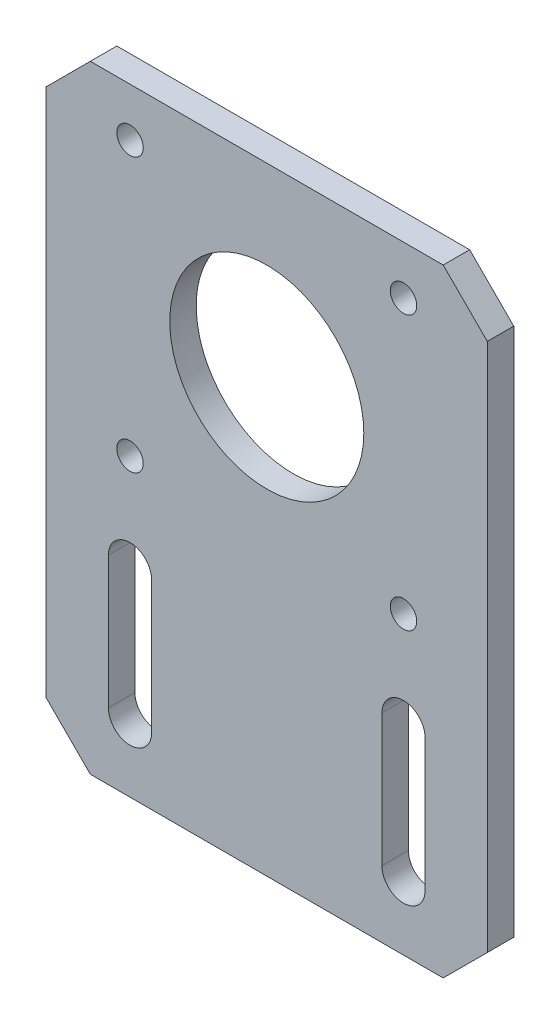
ISO-10303-21;
HEADER;
FILE_DESCRIPTION(('STEP AP214'),'2;1');
FILE_NAME('part.step','',(''),(''),'','','');
FILE_SCHEMA(('AUTOMOTIVE_DESIGN { 1 0 10303 214 1 1 1 1 }'));
ENDSEC;
DATA;
#1=APPLICATION_CONTEXT('core data for automotive mechanical design processes');
#2=APPLICATION_PROTOCOL_DEFINITION('international standard','automotive_design',2000,#1);
#3=PRODUCT_CONTEXT('',#1,'mechanical');
#4=PRODUCT('Part','Part','',(#3));
#5=PRODUCT_RELATED_PRODUCT_CATEGORY('part','',(#4));
#6=PRODUCT_DEFINITION_FORMATION('','',#4);
#7=PRODUCT_DEFINITION_CONTEXT('part definition',#1,'design');
#8=PRODUCT_DEFINITION('design','',#6,#7);
#9=PRODUCT_DEFINITION_SHAPE('','',#8);
#10=(LENGTH_UNIT() NAMED_UNIT(*) SI_UNIT(.MILLI.,.METRE.));
#11=(NAMED_UNIT(*) PLANE_ANGLE_UNIT() SI_UNIT($,.RADIAN.));
#12=(NAMED_UNIT(*) SI_UNIT($,.STERADIAN.) SOLID_ANGLE_UNIT());
#13=UNCERTAINTY_MEASURE_WITH_UNIT(LENGTH_MEASURE(1.E-05),#10,'distance_accuracy_value','');
#14=(GEOMETRIC_REPRESENTATION_CONTEXT(3) GLOBAL_UNCERTAINTY_ASSIGNED_CONTEXT((#13)) GLOBAL_UNIT_ASSIGNED_CONTEXT((#10,
#11,#12)) REPRESENTATION_CONTEXT('',''));
#15=CARTESIAN_POINT('',(0.,0.,0.));
#16=DIRECTION('',(0.,0.,1.));
#17=DIRECTION('',(1.,0.,0.));
#18=AXIS2_PLACEMENT_3D('',#15,#16,#17);
#19=CARTESIAN_POINT('',(0.,0.,3.));
#20=DIRECTION('',(0.,0.,1.));
#21=DIRECTION('',(1.,0.,0.));
#22=AXIS2_PLACEMENT_3D('',#19,#20,#21);
#23=PLANE('',#22);
#24=CARTESIAN_POINT('',(-15.5,-15.5,3.));
#25=DIRECTION('',(0.,0.,1.));
#26=DIRECTION('',(-1.,0.,0.));
#27=AXIS2_PLACEMENT_3D('',#24,#25,#26);
#28=CIRCLE('',#27,1.5);
#29=CARTESIAN_POINT('',(-17.,-15.5,3.));
#30=VERTEX_POINT('',#29);
#31=EDGE_CURVE('E254',#30,#30,#28,.T.);
#32=ORIENTED_EDGE('',*,*,#31,.F.);
#33=EDGE_LOOP('',(#32));
#34=FACE_BOUND('',#33,.T.);
#35=CARTESIAN_POINT('',(-15.5,15.5,3.));
#36=DIRECTION('',(0.,0.,1.));
#37=DIRECTION('',(1.,0.,0.));
#38=AXIS2_PLACEMENT_3D('',#35,#36,#37);
#39=CIRCLE('',#38,1.5);
#40=CARTESIAN_POINT('',(-14.,15.5,3.));
#41=VERTEX_POINT('',#40);
#42=EDGE_CURVE('E270',#41,#41,#39,.T.);
#43=ORIENTED_EDGE('',*,*,#42,.F.);
#44=EDGE_LOOP('',(#43));
#45=FACE_BOUND('',#44,.T.);
#46=DIRECTION('',(-0.707106781186548,0.707106781186548,0.));
#47=VECTOR('',#46,1.);
#48=CARTESIAN_POINT('',(25.,16.,3.));
#49=LINE('',#48,#47);
#50=CARTESIAN_POINT('',(25.,16.,3.));
#51=VERTEX_POINT('',#50);
#52=CARTESIAN_POINT('',(20.,21.,3.));
#53=VERTEX_POINT('',#52);
#54=EDGE_CURVE('E286',#51,#53,#49,.T.);
#55=ORIENTED_EDGE('',*,*,#54,.T.);
#56=DIRECTION('',(-1.,0.,0.));
#57=VECTOR('',#56,1.);
#58=CARTESIAN_POINT('',(20.,21.,3.));
#59=LINE('',#58,#57);
#60=CARTESIAN_POINT('',(-20.,21.,3.));
#61=VERTEX_POINT('',#60);
#62=EDGE_CURVE('E290',#53,#61,#59,.T.);
#63=ORIENTED_EDGE('',*,*,#62,.T.);
#64=DIRECTION('',(-0.707106781186547,-0.707106781186548,0.));
#65=VECTOR('',#64,1.);
#66=CARTESIAN_POINT('',(-20.,21.,3.));
#67=LINE('',#66,#65);
#68=CARTESIAN_POINT('',(-25.,16.,3.));
#69=VERTEX_POINT('',#68);
#70=EDGE_CURVE('E294',#61,#69,#67,.T.);
#71=ORIENTED_EDGE('',*,*,#70,.T.);
#72=DIRECTION('',(0.,-1.,0.));
#73=VECTOR('',#72,1.);
#74=CARTESIAN_POINT('',(-25.,-44.,3.));
#75=LINE('',#74,#73);
#76=CARTESIAN_POINT('',(-25.,-44.,3.));
#77=VERTEX_POINT('',#76);
#78=EDGE_CURVE('E297',#69,#77,#75,.T.);
#79=ORIENTED_EDGE('',*,*,#78,.T.);
#80=DIRECTION('',(0.707106781186548,-0.707106781186547,0.));
#81=VECTOR('',#80,1.);
#82=CARTESIAN_POINT('',(-20.,-49.,3.));
#83=LINE('',#82,#81);
#84=CARTESIAN_POINT('',(-20.,-49.,3.));
#85=VERTEX_POINT('',#84);
#86=EDGE_CURVE('E300',#77,#85,#83,.T.);
#87=ORIENTED_EDGE('',*,*,#86,.T.);
#88=DIRECTION('',(1.,0.,0.));
#89=VECTOR('',#88,1.);
#90=CARTESIAN_POINT('',(20.,-49.,3.));
#91=LINE('',#90,#89);
#92=CARTESIAN_POINT('',(20.,-49.,3.));
#93=VERTEX_POINT('',#92);
#94=EDGE_CURVE('E303',#85,#93,#91,.T.);
#95=ORIENTED_EDGE('',*,*,#94,.T.);
#96=DIRECTION('',(0.707106781186548,0.707106781186547,0.));
#97=VECTOR('',#96,1.);
#98=CARTESIAN_POINT('',(25.,-44.,3.));
#99=LINE('',#98,#97);
#100=CARTESIAN_POINT('',(25.,-44.,3.));
#101=VERTEX_POINT('',#100);
#102=EDGE_CURVE('E306',#93,#101,#99,.T.);
#103=ORIENTED_EDGE('',*,*,#102,.T.);
#104=DIRECTION('',(0.,1.,0.));
#105=VECTOR('',#104,1.);
#106=CARTESIAN_POINT('',(25.,-44.,3.));
#107=LINE('',#106,#105);
#108=EDGE_CURVE('E309',#101,#51,#107,.T.);
#109=ORIENTED_EDGE('',*,*,#108,.T.);
#110=EDGE_LOOP('',(#55,#63,#71,#79,#87,#95,#103,#109));
#111=FACE_BOUND('',#110,.T.);
#112=CARTESIAN_POINT('',(0.,0.,3.));
#113=DIRECTION('',(0.,0.,1.));
#114=DIRECTION('',(1.,0.,0.));
#115=AXIS2_PLACEMENT_3D('',#112,#113,#114);
#116=CIRCLE('',#115,11.);
#117=CARTESIAN_POINT('',(11.,0.,3.));
#118=VERTEX_POINT('',#117);
#119=EDGE_CURVE('E278',#118,#118,#116,.T.);
#120=ORIENTED_EDGE('',*,*,#119,.F.);
#121=EDGE_LOOP('',(#120));
#122=FACE_BOUND('',#121,.T.);
#123=CARTESIAN_POINT('',(15.5,15.5,3.));
#124=DIRECTION('',(0.,0.,1.));
#125=DIRECTION('',(-1.,0.,0.));
#126=AXIS2_PLACEMENT_3D('',#123,#124,#125);
#127=CIRCLE('',#126,1.5);
#128=CARTESIAN_POINT('',(14.,15.5,3.));
#129=VERTEX_POINT('',#128);
#130=EDGE_CURVE('E262',#129,#129,#127,.T.);
#131=ORIENTED_EDGE('',*,*,#130,.F.);
#132=EDGE_LOOP('',(#131));
#133=FACE_BOUND('',#132,.T.);
#134=CARTESIAN_POINT('',(15.5,-15.5,3.));
#135=DIRECTION('',(0.,0.,1.));
#136=DIRECTION('',(1.,0.,0.));
#137=AXIS2_PLACEMENT_3D('',#134,#135,#136);
#138=CIRCLE('',#137,1.5);
#139=CARTESIAN_POINT('',(17.,-15.5,3.));
#140=VERTEX_POINT('',#139);
#141=EDGE_CURVE('E246',#140,#140,#138,.T.);
#142=ORIENTED_EDGE('',*,*,#141,.F.);
#143=EDGE_LOOP('',(#142));
#144=FACE_BOUND('',#143,.T.);
#145=DIRECTION('',(0.,-1.,0.));
#146=VECTOR('',#145,1.);
#147=CARTESIAN_POINT('',(-17.95,-26.45,3.));
#148=LINE('',#147,#146);
#149=CARTESIAN_POINT('',(-17.95,-26.45,3.));
#150=VERTEX_POINT('',#149);
#151=CARTESIAN_POINT('',(-17.95,-41.45,3.));
#152=VERTEX_POINT('',#151);
#153=EDGE_CURVE('E206',#150,#152,#148,.T.);
#154=ORIENTED_EDGE('',*,*,#153,.F.);
#155=CARTESIAN_POINT('',(-15.5,-26.45,3.));
#156=DIRECTION('',(0.,0.,1.));
#157=DIRECTION('',(1.,0.,0.));
#158=AXIS2_PLACEMENT_3D('',#155,#156,#157);
#159=CIRCLE('',#158,2.45000000000001);
#160=CARTESIAN_POINT('',(-13.05,-26.45,3.));
#161=VERTEX_POINT('',#160);
#162=EDGE_CURVE('E203',#161,#150,#159,.T.);
#163=ORIENTED_EDGE('',*,*,#162,.F.);
#164=DIRECTION('',(0.,1.,0.));
#165=VECTOR('',#164,1.);
#166=CARTESIAN_POINT('',(-13.05,-26.45,3.));
#167=LINE('',#166,#165);
#168=CARTESIAN_POINT('',(-13.05,-41.45,3.));
#169=VERTEX_POINT('',#168);
#170=EDGE_CURVE('E214',#169,#161,#167,.T.);
#171=ORIENTED_EDGE('',*,*,#170,.F.);
#172=CARTESIAN_POINT('',(-15.5,-41.45,3.));
#173=DIRECTION('',(0.,0.,1.));
#174=DIRECTION('',(1.,0.,0.));
#175=AXIS2_PLACEMENT_3D('',#172,#173,#174);
#176=CIRCLE('',#175,2.45000000000002);
#177=EDGE_CURVE('E210',#152,#169,#176,.T.);
#178=ORIENTED_EDGE('',*,*,#177,.F.);
#179=EDGE_LOOP('',(#154,#163,#171,#178));
#180=FACE_BOUND('',#179,.T.);
#181=DIRECTION('',(0.,-1.,0.));
#182=VECTOR('',#181,1.);
#183=CARTESIAN_POINT('',(13.05,-26.45,3.));
#184=LINE('',#183,#182);
#185=CARTESIAN_POINT('',(13.05,-26.45,3.));
#186=VERTEX_POINT('',#185);
#187=CARTESIAN_POINT('',(13.05,-41.45,3.));
#188=VERTEX_POINT('',#187);
#189=EDGE_CURVE('E164',#186,#188,#184,.T.);
#190=ORIENTED_EDGE('',*,*,#189,.F.);
#191=CARTESIAN_POINT('',(15.5,-26.45,3.));
#192=DIRECTION('',(0.,0.,1.));
#193=DIRECTION('',(-1.,0.,0.));
#194=AXIS2_PLACEMENT_3D('',#191,#192,#193);
#195=CIRCLE('',#194,2.45000000000002);
#196=CARTESIAN_POINT('',(17.95,-26.45,3.));
#197=VERTEX_POINT('',#196);
#198=EDGE_CURVE('E155',#197,#186,#195,.T.);
#199=ORIENTED_EDGE('',*,*,#198,.F.);
#200=DIRECTION('',(0.,1.,0.));
#201=VECTOR('',#200,1.);
#202=CARTESIAN_POINT('',(17.95,-26.45,3.));
#203=LINE('',#202,#201);
#204=CARTESIAN_POINT('',(17.95,-41.45,3.));
#205=VERTEX_POINT('',#204);
#206=EDGE_CURVE('E181',#205,#197,#203,.T.);
#207=ORIENTED_EDGE('',*,*,#206,.F.);
#208=CARTESIAN_POINT('',(15.5,-41.45,3.));
#209=DIRECTION('',(0.,0.,1.));
#210=DIRECTION('',(-1.,0.,0.));
#211=AXIS2_PLACEMENT_3D('',#208,#209,#210);
#212=CIRCLE('',#211,2.45000000000002);
#213=EDGE_CURVE('E177',#188,#205,#212,.T.);
#214=ORIENTED_EDGE('',*,*,#213,.F.);
#215=EDGE_LOOP('',(#190,#199,#207,#214));
#216=FACE_BOUND('',#215,.T.);
#217=ADVANCED_FACE('F41',(#34,#45,#111,#122,#133,#144,#180,#216),#23,.T.);
#218=CARTESIAN_POINT('',(0.,0.,0.));
#219=DIRECTION('',(0.,0.,1.));
#220=DIRECTION('',(1.,0.,0.));
#221=AXIS2_PLACEMENT_3D('',#218,#219,#220);
#222=PLANE('',#221);
#223=CARTESIAN_POINT('',(-15.5,-26.45,0.));
#224=DIRECTION('',(0.,0.,1.));
#225=DIRECTION('',(1.,0.,0.));
#226=AXIS2_PLACEMENT_3D('',#223,#224,#225);
#227=CIRCLE('',#226,2.45000000000001);
#228=CARTESIAN_POINT('',(-13.05,-26.45,0.));
#229=VERTEX_POINT('',#228);
#230=CARTESIAN_POINT('',(-17.95,-26.45,0.));
#231=VERTEX_POINT('',#230);
#232=EDGE_CURVE('E173',#229,#231,#227,.T.);
#233=ORIENTED_EDGE('',*,*,#232,.T.);
#234=DIRECTION('',(0.,-1.,0.));
#235=VECTOR('',#234,1.);
#236=CARTESIAN_POINT('',(-17.95,-26.45,0.));
#237=LINE('',#236,#235);
#238=CARTESIAN_POINT('',(-17.95,-41.45,0.));
#239=VERTEX_POINT('',#238);
#240=EDGE_CURVE('E221',#231,#239,#237,.T.);
#241=ORIENTED_EDGE('',*,*,#240,.T.);
#242=CARTESIAN_POINT('',(-15.5,-41.45,0.));
#243=DIRECTION('',(0.,0.,1.));
#244=DIRECTION('',(1.,0.,0.));
#245=AXIS2_PLACEMENT_3D('',#242,#243,#244);
#246=CIRCLE('',#245,2.45000000000002);
#247=CARTESIAN_POINT('',(-13.05,-41.45,0.));
#248=VERTEX_POINT('',#247);
#249=EDGE_CURVE('E225',#239,#248,#246,.T.);
#250=ORIENTED_EDGE('',*,*,#249,.T.);
#251=DIRECTION('',(0.,1.,0.));
#252=VECTOR('',#251,1.);
#253=CARTESIAN_POINT('',(-13.05,-26.45,0.));
#254=LINE('',#253,#252);
#255=EDGE_CURVE('E207',#248,#229,#254,.T.);
#256=ORIENTED_EDGE('',*,*,#255,.T.);
#257=EDGE_LOOP('',(#233,#241,#250,#256));
#258=FACE_BOUND('',#257,.T.);
#259=DIRECTION('',(-0.707106781186548,0.707106781186548,0.));
#260=VECTOR('',#259,1.);
#261=CARTESIAN_POINT('',(25.,16.,0.));
#262=LINE('',#261,#260);
#263=CARTESIAN_POINT('',(25.,16.,0.));
#264=VERTEX_POINT('',#263);
#265=CARTESIAN_POINT('',(20.,21.,0.));
#266=VERTEX_POINT('',#265);
#267=EDGE_CURVE('E282',#264,#266,#262,.T.);
#268=ORIENTED_EDGE('',*,*,#267,.F.);
#269=DIRECTION('',(0.,1.,0.));
#270=VECTOR('',#269,1.);
#271=CARTESIAN_POINT('',(25.,-44.,0.));
#272=LINE('',#271,#270);
#273=CARTESIAN_POINT('',(25.,-44.,0.));
#274=VERTEX_POINT('',#273);
#275=EDGE_CURVE('E291',#274,#264,#272,.T.);
#276=ORIENTED_EDGE('',*,*,#275,.F.);
#277=DIRECTION('',(0.707106781186548,0.707106781186547,0.));
#278=VECTOR('',#277,1.);
#279=CARTESIAN_POINT('',(25.,-44.,0.));
#280=LINE('',#279,#278);
#281=CARTESIAN_POINT('',(20.,-49.,0.));
#282=VERTEX_POINT('',#281);
#283=EDGE_CURVE('E331',#282,#274,#280,.T.);
#284=ORIENTED_EDGE('',*,*,#283,.F.);
#285=DIRECTION('',(1.,0.,0.));
#286=VECTOR('',#285,1.);
#287=CARTESIAN_POINT('',(20.,-49.,0.));
#288=LINE('',#287,#286);
#289=CARTESIAN_POINT('',(-20.,-49.,0.));
#290=VERTEX_POINT('',#289);
#291=EDGE_CURVE('E328',#290,#282,#288,.T.);
#292=ORIENTED_EDGE('',*,*,#291,.F.);
#293=DIRECTION('',(0.707106781186548,-0.707106781186547,0.));
#294=VECTOR('',#293,1.);
#295=CARTESIAN_POINT('',(-20.,-49.,0.));
#296=LINE('',#295,#294);
#297=CARTESIAN_POINT('',(-25.,-44.,0.));
#298=VERTEX_POINT('',#297);
#299=EDGE_CURVE('E325',#298,#290,#296,.T.);
#300=ORIENTED_EDGE('',*,*,#299,.F.);
#301=DIRECTION('',(0.,-1.,0.));
#302=VECTOR('',#301,1.);
#303=CARTESIAN_POINT('',(-25.,-44.,0.));
#304=LINE('',#303,#302);
#305=CARTESIAN_POINT('',(-25.,16.,0.));
#306=VERTEX_POINT('',#305);
#307=EDGE_CURVE('E322',#306,#298,#304,.T.);
#308=ORIENTED_EDGE('',*,*,#307,.F.);
#309=DIRECTION('',(-0.707106781186547,-0.707106781186548,0.));
#310=VECTOR('',#309,1.);
#311=CARTESIAN_POINT('',(-20.,21.,0.));
#312=LINE('',#311,#310);
#313=CARTESIAN_POINT('',(-20.,21.,0.));
#314=VERTEX_POINT('',#313);
#315=EDGE_CURVE('E319',#314,#306,#312,.T.);
#316=ORIENTED_EDGE('',*,*,#315,.F.);
#317=DIRECTION('',(-1.,0.,0.));
#318=VECTOR('',#317,1.);
#319=CARTESIAN_POINT('',(20.,21.,0.));
#320=LINE('',#319,#318);
#321=EDGE_CURVE('E316',#266,#314,#320,.T.);
#322=ORIENTED_EDGE('',*,*,#321,.F.);
#323=EDGE_LOOP('',(#268,#276,#284,#292,#300,#308,#316,#322));
#324=FACE_BOUND('',#323,.T.);
#325=CARTESIAN_POINT('',(0.,0.,0.));
#326=DIRECTION('',(0.,0.,1.));
#327=DIRECTION('',(1.,0.,0.));
#328=AXIS2_PLACEMENT_3D('',#325,#326,#327);
#329=CIRCLE('',#328,11.);
#330=CARTESIAN_POINT('',(11.,0.,0.));
#331=VERTEX_POINT('',#330);
#332=EDGE_CURVE('E274',#331,#331,#329,.T.);
#333=ORIENTED_EDGE('',*,*,#332,.T.);
#334=EDGE_LOOP('',(#333));
#335=FACE_BOUND('',#334,.T.);
#336=CARTESIAN_POINT('',(-15.5,15.5,0.));
#337=DIRECTION('',(0.,0.,1.));
#338=DIRECTION('',(1.,0.,0.));
#339=AXIS2_PLACEMENT_3D('',#336,#337,#338);
#340=CIRCLE('',#339,1.5);
#341=CARTESIAN_POINT('',(-14.,15.5,0.));
#342=VERTEX_POINT('',#341);
#343=EDGE_CURVE('E266',#342,#342,#340,.T.);
#344=ORIENTED_EDGE('',*,*,#343,.T.);
#345=EDGE_LOOP('',(#344));
#346=FACE_BOUND('',#345,.T.);
#347=CARTESIAN_POINT('',(15.5,15.5,0.));
#348=DIRECTION('',(0.,0.,1.));
#349=DIRECTION('',(-1.,0.,0.));
#350=AXIS2_PLACEMENT_3D('',#347,#348,#349);
#351=CIRCLE('',#350,1.5);
#352=CARTESIAN_POINT('',(14.,15.5,0.));
#353=VERTEX_POINT('',#352);
#354=EDGE_CURVE('E258',#353,#353,#351,.T.);
#355=ORIENTED_EDGE('',*,*,#354,.T.);
#356=EDGE_LOOP('',(#355));
#357=FACE_BOUND('',#356,.T.);
#358=CARTESIAN_POINT('',(-15.5,-15.5,0.));
#359=DIRECTION('',(0.,0.,1.));
#360=DIRECTION('',(-1.,0.,0.));
#361=AXIS2_PLACEMENT_3D('',#358,#359,#360);
#362=CIRCLE('',#361,1.5);
#363=CARTESIAN_POINT('',(-17.,-15.5,0.));
#364=VERTEX_POINT('',#363);
#365=EDGE_CURVE('E250',#364,#364,#362,.T.);
#366=ORIENTED_EDGE('',*,*,#365,.T.);
#367=EDGE_LOOP('',(#366));
#368=FACE_BOUND('',#367,.T.);
#369=CARTESIAN_POINT('',(15.5,-15.5,0.));
#370=DIRECTION('',(0.,0.,1.));
#371=DIRECTION('',(1.,0.,0.));
#372=AXIS2_PLACEMENT_3D('',#369,#370,#371);
#373=CIRCLE('',#372,1.5);
#374=CARTESIAN_POINT('',(17.,-15.5,0.));
#375=VERTEX_POINT('',#374);
#376=EDGE_CURVE('E245',#375,#375,#373,.T.);
#377=ORIENTED_EDGE('',*,*,#376,.T.);
#378=EDGE_LOOP('',(#377));
#379=FACE_BOUND('',#378,.T.);
#380=CARTESIAN_POINT('',(15.5,-26.45,0.));
#381=DIRECTION('',(0.,0.,1.));
#382=DIRECTION('',(-1.,0.,0.));
#383=AXIS2_PLACEMENT_3D('',#380,#381,#382);
#384=CIRCLE('',#383,2.45000000000002);
#385=CARTESIAN_POINT('',(17.95,-26.45,0.));
#386=VERTEX_POINT('',#385);
#387=CARTESIAN_POINT('',(13.05,-26.45,0.));
#388=VERTEX_POINT('',#387);
#389=EDGE_CURVE('E65',#386,#388,#384,.T.);
#390=ORIENTED_EDGE('',*,*,#389,.T.);
#391=DIRECTION('',(0.,-1.,0.));
#392=VECTOR('',#391,1.);
#393=CARTESIAN_POINT('',(13.05,-26.45,0.));
#394=LINE('',#393,#392);
#395=CARTESIAN_POINT('',(13.05,-41.45,0.));
#396=VERTEX_POINT('',#395);
#397=EDGE_CURVE('E171',#388,#396,#394,.T.);
#398=ORIENTED_EDGE('',*,*,#397,.T.);
#399=CARTESIAN_POINT('',(15.5,-41.45,0.));
#400=DIRECTION('',(0.,0.,1.));
#401=DIRECTION('',(-1.,0.,0.));
#402=AXIS2_PLACEMENT_3D('',#399,#400,#401);
#403=CIRCLE('',#402,2.45000000000002);
#404=CARTESIAN_POINT('',(17.95,-41.45,0.));
#405=VERTEX_POINT('',#404);
#406=EDGE_CURVE('E190',#396,#405,#403,.T.);
#407=ORIENTED_EDGE('',*,*,#406,.T.);
#408=DIRECTION('',(0.,1.,0.));
#409=VECTOR('',#408,1.);
#410=CARTESIAN_POINT('',(17.95,-26.45,0.));
#411=LINE('',#410,#409);
#412=EDGE_CURVE('E165',#405,#386,#411,.T.);
#413=ORIENTED_EDGE('',*,*,#412,.T.);
#414=EDGE_LOOP('',(#390,#398,#407,#413));
#415=FACE_BOUND('',#414,.T.);
#416=ADVANCED_FACE('F370',(#258,#324,#335,#346,#357,#368,#379,#415),#222,.F.);
#417=CARTESIAN_POINT('',(25.,16.,3.));
#418=DIRECTION('',(-0.707106781186547,-0.707106781186547,0.));
#419=DIRECTION('',(0.707106781186548,-0.707106781186548,0.));
#420=AXIS2_PLACEMENT_3D('',#417,#418,#419);
#421=PLANE('',#420);
#422=ORIENTED_EDGE('',*,*,#267,.T.);
#423=DIRECTION('',(0.,0.,-1.));
#424=VECTOR('',#423,1.);
#425=CARTESIAN_POINT('',(20.,21.,3.));
#426=LINE('',#425,#424);
#427=EDGE_CURVE('E11',#53,#266,#426,.T.);
#428=ORIENTED_EDGE('',*,*,#427,.F.);
#429=ORIENTED_EDGE('',*,*,#54,.F.);
#430=DIRECTION('',(0.,0.,-1.));
#431=VECTOR('',#430,1.);
#432=CARTESIAN_POINT('',(25.,16.,3.));
#433=LINE('',#432,#431);
#434=EDGE_CURVE('E312',#51,#264,#433,.T.);
#435=ORIENTED_EDGE('',*,*,#434,.T.);
#436=EDGE_LOOP('',(#422,#428,#429,#435));
#437=FACE_BOUND('',#436,.T.);
#438=ADVANCED_FACE('F43',(#437),#421,.F.);
#439=CARTESIAN_POINT('',(20.,21.,3.));
#440=DIRECTION('',(0.,-1.,0.));
#441=DIRECTION('',(1.,0.,0.));
#442=AXIS2_PLACEMENT_3D('',#439,#440,#441);
#443=PLANE('',#442);
#444=ORIENTED_EDGE('',*,*,#321,.T.);
#445=DIRECTION('',(0.,0.,-1.));
#446=VECTOR('',#445,1.);
#447=CARTESIAN_POINT('',(-20.,21.,3.));
#448=LINE('',#447,#446);
#449=EDGE_CURVE('E50',#61,#314,#448,.T.);
#450=ORIENTED_EDGE('',*,*,#449,.F.);
#451=ORIENTED_EDGE('',*,*,#62,.F.);
#452=ORIENTED_EDGE('',*,*,#427,.T.);
#453=EDGE_LOOP('',(#444,#450,#451,#452));
#454=FACE_BOUND('',#453,.T.);
#455=ADVANCED_FACE('F388',(#454),#443,.F.);
#456=CARTESIAN_POINT('',(-20.,21.,3.));
#457=DIRECTION('',(0.707106781186548,-0.707106781186547,0.));
#458=DIRECTION('',(0.707106781186547,0.707106781186548,0.));
#459=AXIS2_PLACEMENT_3D('',#456,#457,#458);
#460=PLANE('',#459);
#461=ORIENTED_EDGE('',*,*,#315,.T.);
#462=DIRECTION('',(0.,0.,-1.));
#463=VECTOR('',#462,1.);
#464=CARTESIAN_POINT('',(-25.,16.,3.));
#465=LINE('',#464,#463);
#466=EDGE_CURVE('E355',#69,#306,#465,.T.);
#467=ORIENTED_EDGE('',*,*,#466,.F.);
#468=ORIENTED_EDGE('',*,*,#70,.F.);
#469=ORIENTED_EDGE('',*,*,#449,.T.);
#470=EDGE_LOOP('',(#461,#467,#468,#469));
#471=FACE_BOUND('',#470,.T.);
#472=ADVANCED_FACE('F364',(#471),#460,.F.);
#473=CARTESIAN_POINT('',(-25.,-44.,3.));
#474=DIRECTION('',(1.,0.,0.));
#475=DIRECTION('',(0.,1.,0.));
#476=AXIS2_PLACEMENT_3D('',#473,#474,#475);
#477=PLANE('',#476);
#478=ORIENTED_EDGE('',*,*,#307,.T.);
#479=DIRECTION('',(0.,0.,-1.));
#480=VECTOR('',#479,1.);
#481=CARTESIAN_POINT('',(-25.,-44.,3.));
#482=LINE('',#481,#480);
#483=EDGE_CURVE('E351',#77,#298,#482,.T.);
#484=ORIENTED_EDGE('',*,*,#483,.F.);
#485=ORIENTED_EDGE('',*,*,#78,.F.);
#486=ORIENTED_EDGE('',*,*,#466,.T.);
#487=EDGE_LOOP('',(#478,#484,#485,#486));
#488=FACE_BOUND('',#487,.T.);
#489=ADVANCED_FACE('F376',(#488),#477,.F.);
#490=CARTESIAN_POINT('',(-20.,-49.,3.));
#491=DIRECTION('',(0.707106781186547,0.707106781186548,0.));
#492=DIRECTION('',(-0.707106781186548,0.707106781186547,0.));
#493=AXIS2_PLACEMENT_3D('',#490,#491,#492);
#494=PLANE('',#493);
#495=ORIENTED_EDGE('',*,*,#299,.T.);
#496=DIRECTION('',(0.,0.,-1.));
#497=VECTOR('',#496,1.);
#498=CARTESIAN_POINT('',(-20.,-49.,3.));
#499=LINE('',#498,#497);
#500=EDGE_CURVE('E347',#85,#290,#499,.T.);
#501=ORIENTED_EDGE('',*,*,#500,.F.);
#502=ORIENTED_EDGE('',*,*,#86,.F.);
#503=ORIENTED_EDGE('',*,*,#483,.T.);
#504=EDGE_LOOP('',(#495,#501,#502,#503));
#505=FACE_BOUND('',#504,.T.);
#506=ADVANCED_FACE('F380',(#505),#494,.F.);
#507=CARTESIAN_POINT('',(20.,-49.,3.));
#508=DIRECTION('',(0.,1.,0.));
#509=DIRECTION('',(-1.,0.,0.));
#510=AXIS2_PLACEMENT_3D('',#507,#508,#509);
#511=PLANE('',#510);
#512=ORIENTED_EDGE('',*,*,#291,.T.);
#513=DIRECTION('',(0.,0.,-1.));
#514=VECTOR('',#513,1.);
#515=CARTESIAN_POINT('',(20.,-49.,3.));
#516=LINE('',#515,#514);
#517=EDGE_CURVE('E343',#93,#282,#516,.T.);
#518=ORIENTED_EDGE('',*,*,#517,.F.);
#519=ORIENTED_EDGE('',*,*,#94,.F.);
#520=ORIENTED_EDGE('',*,*,#500,.T.);
#521=EDGE_LOOP('',(#512,#518,#519,#520));
#522=FACE_BOUND('',#521,.T.);
#523=ADVANCED_FACE('F401',(#522),#511,.F.);
#524=CARTESIAN_POINT('',(25.,-44.,3.));
#525=DIRECTION('',(-0.707106781186547,0.707106781186548,0.));
#526=DIRECTION('',(-0.707106781186548,-0.707106781186547,0.));
#527=AXIS2_PLACEMENT_3D('',#524,#525,#526);
#528=PLANE('',#527);
#529=ORIENTED_EDGE('',*,*,#283,.T.);
#530=DIRECTION('',(0.,0.,-1.));
#531=VECTOR('',#530,1.);
#532=CARTESIAN_POINT('',(25.,-44.,3.));
#533=LINE('',#532,#531);
#534=EDGE_CURVE('E339',#101,#274,#533,.T.);
#535=ORIENTED_EDGE('',*,*,#534,.F.);
#536=ORIENTED_EDGE('',*,*,#102,.F.);
#537=ORIENTED_EDGE('',*,*,#517,.T.);
#538=EDGE_LOOP('',(#529,#535,#536,#537));
#539=FACE_BOUND('',#538,.T.);
#540=ADVANCED_FACE('F399',(#539),#528,.F.);
#541=CARTESIAN_POINT('',(25.,-44.,3.));
#542=DIRECTION('',(-1.,0.,0.));
#543=DIRECTION('',(0.,-1.,0.));
#544=AXIS2_PLACEMENT_3D('',#541,#542,#543);
#545=PLANE('',#544);
#546=ORIENTED_EDGE('',*,*,#275,.T.);
#547=ORIENTED_EDGE('',*,*,#434,.F.);
#548=ORIENTED_EDGE('',*,*,#108,.F.);
#549=ORIENTED_EDGE('',*,*,#534,.T.);
#550=EDGE_LOOP('',(#546,#547,#548,#549));
#551=FACE_BOUND('',#550,.T.);
#552=ADVANCED_FACE('F394',(#551),#545,.F.);
#553=CARTESIAN_POINT('',(0.,0.,3.));
#554=DIRECTION('',(0.,0.,-1.));
#555=DIRECTION('',(-1.,0.,0.));
#556=AXIS2_PLACEMENT_3D('',#553,#554,#555);
#557=CYLINDRICAL_SURFACE('',#556,11.);
#558=ORIENTED_EDGE('',*,*,#119,.T.);
#559=EDGE_LOOP('',(#558));
#560=FACE_BOUND('',#559,.T.);
#561=ORIENTED_EDGE('',*,*,#332,.F.);
#562=EDGE_LOOP('',(#561));
#563=FACE_BOUND('',#562,.T.);
#564=ADVANCED_FACE('F421',(#560,#563),#557,.F.);
#565=CARTESIAN_POINT('',(-15.5,15.5,3.));
#566=DIRECTION('',(0.,0.,-1.));
#567=DIRECTION('',(-1.,0.,0.));
#568=AXIS2_PLACEMENT_3D('',#565,#566,#567);
#569=CYLINDRICAL_SURFACE('',#568,1.5);
#570=ORIENTED_EDGE('',*,*,#42,.T.);
#571=EDGE_LOOP('',(#570));
#572=FACE_BOUND('',#571,.T.);
#573=ORIENTED_EDGE('',*,*,#343,.F.);
#574=EDGE_LOOP('',(#573));
#575=FACE_BOUND('',#574,.T.);
#576=ADVANCED_FACE('F428',(#572,#575),#569,.F.);
#577=CARTESIAN_POINT('',(15.5,15.5,3.));
#578=DIRECTION('',(0.,0.,-1.));
#579=DIRECTION('',(-1.,0.,0.));
#580=AXIS2_PLACEMENT_3D('',#577,#578,#579);
#581=CYLINDRICAL_SURFACE('',#580,1.5);
#582=ORIENTED_EDGE('',*,*,#130,.T.);
#583=EDGE_LOOP('',(#582));
#584=FACE_BOUND('',#583,.T.);
#585=ORIENTED_EDGE('',*,*,#354,.F.);
#586=EDGE_LOOP('',(#585));
#587=FACE_BOUND('',#586,.T.);
#588=ADVANCED_FACE('F433',(#584,#587),#581,.F.);
#589=CARTESIAN_POINT('',(-15.5,-15.5,3.));
#590=DIRECTION('',(0.,0.,-1.));
#591=DIRECTION('',(-1.,0.,0.));
#592=AXIS2_PLACEMENT_3D('',#589,#590,#591);
#593=CYLINDRICAL_SURFACE('',#592,1.5);
#594=ORIENTED_EDGE('',*,*,#31,.T.);
#595=EDGE_LOOP('',(#594));
#596=FACE_BOUND('',#595,.T.);
#597=ORIENTED_EDGE('',*,*,#365,.F.);
#598=EDGE_LOOP('',(#597));
#599=FACE_BOUND('',#598,.T.);
#600=ADVANCED_FACE('F481',(#596,#599),#593,.F.);
#601=CARTESIAN_POINT('',(15.5,-15.5,3.));
#602=DIRECTION('',(0.,0.,-1.));
#603=DIRECTION('',(-1.,0.,0.));
#604=AXIS2_PLACEMENT_3D('',#601,#602,#603);
#605=CYLINDRICAL_SURFACE('',#604,1.5);
#606=ORIENTED_EDGE('',*,*,#141,.T.);
#607=EDGE_LOOP('',(#606));
#608=FACE_BOUND('',#607,.T.);
#609=ORIENTED_EDGE('',*,*,#376,.F.);
#610=EDGE_LOOP('',(#609));
#611=FACE_BOUND('',#610,.T.);
#612=ADVANCED_FACE('F477',(#608,#611),#605,.F.);
#613=CARTESIAN_POINT('',(-15.5,-26.45,3.));
#614=DIRECTION('',(0.,0.,-1.));
#615=DIRECTION('',(-1.,0.,0.));
#616=AXIS2_PLACEMENT_3D('',#613,#614,#615);
#617=CYLINDRICAL_SURFACE('',#616,2.45000000000001);
#618=ORIENTED_EDGE('',*,*,#232,.F.);
#619=DIRECTION('',(0.,0.,-1.));
#620=VECTOR('',#619,1.);
#621=CARTESIAN_POINT('',(-13.05,-26.45,3.));
#622=LINE('',#621,#620);
#623=EDGE_CURVE('E217',#161,#229,#622,.T.);
#624=ORIENTED_EDGE('',*,*,#623,.F.);
#625=ORIENTED_EDGE('',*,*,#162,.T.);
#626=DIRECTION('',(0.,0.,-1.));
#627=VECTOR('',#626,1.);
#628=CARTESIAN_POINT('',(-17.95,-26.45,3.));
#629=LINE('',#628,#627);
#630=EDGE_CURVE('E241',#150,#231,#629,.T.);
#631=ORIENTED_EDGE('',*,*,#630,.T.);
#632=EDGE_LOOP('',(#618,#624,#625,#631));
#633=FACE_BOUND('',#632,.T.);
#634=ADVANCED_FACE('F473',(#633),#617,.F.);
#635=CARTESIAN_POINT('',(-17.95,-26.45,3.));
#636=DIRECTION('',(1.,0.,0.));
#637=DIRECTION('',(0.,0.,-1.));
#638=AXIS2_PLACEMENT_3D('',#635,#636,#637);
#639=PLANE('',#638);
#640=ORIENTED_EDGE('',*,*,#240,.F.);
#641=ORIENTED_EDGE('',*,*,#630,.F.);
#642=ORIENTED_EDGE('',*,*,#153,.T.);
#643=DIRECTION('',(0.,0.,-1.));
#644=VECTOR('',#643,1.);
#645=CARTESIAN_POINT('',(-17.95,-41.45,3.));
#646=LINE('',#645,#644);
#647=EDGE_CURVE('E238',#152,#239,#646,.T.);
#648=ORIENTED_EDGE('',*,*,#647,.T.);
#649=EDGE_LOOP('',(#640,#641,#642,#648));
#650=FACE_BOUND('',#649,.T.);
#651=ADVANCED_FACE('F469',(#650),#639,.T.);
#652=CARTESIAN_POINT('',(-15.5,-41.45,3.));
#653=DIRECTION('',(0.,0.,-1.));
#654=DIRECTION('',(-1.,0.,0.));
#655=AXIS2_PLACEMENT_3D('',#652,#653,#654);
#656=CYLINDRICAL_SURFACE('',#655,2.45000000000002);
#657=ORIENTED_EDGE('',*,*,#249,.F.);
#658=ORIENTED_EDGE('',*,*,#647,.F.);
#659=ORIENTED_EDGE('',*,*,#177,.T.);
#660=DIRECTION('',(0.,0.,-1.));
#661=VECTOR('',#660,1.);
#662=CARTESIAN_POINT('',(-13.05,-41.45,3.));
#663=LINE('',#662,#661);
#664=EDGE_CURVE('E235',#169,#248,#663,.T.);
#665=ORIENTED_EDGE('',*,*,#664,.T.);
#666=EDGE_LOOP('',(#657,#658,#659,#665));
#667=FACE_BOUND('',#666,.T.);
#668=ADVANCED_FACE('F465',(#667),#656,.F.);
#669=CARTESIAN_POINT('',(-13.05,-26.45,3.));
#670=DIRECTION('',(-1.,0.,0.));
#671=DIRECTION('',(0.,-1.,0.));
#672=AXIS2_PLACEMENT_3D('',#669,#670,#671);
#673=PLANE('',#672);
#674=ORIENTED_EDGE('',*,*,#255,.F.);
#675=ORIENTED_EDGE('',*,*,#664,.F.);
#676=ORIENTED_EDGE('',*,*,#170,.T.);
#677=ORIENTED_EDGE('',*,*,#623,.T.);
#678=EDGE_LOOP('',(#674,#675,#676,#677));
#679=FACE_BOUND('',#678,.T.);
#680=ADVANCED_FACE('F462',(#679),#673,.T.);
#681=CARTESIAN_POINT('',(15.5,-26.45,3.));
#682=DIRECTION('',(0.,0.,-1.));
#683=DIRECTION('',(-1.,0.,0.));
#684=AXIS2_PLACEMENT_3D('',#681,#682,#683);
#685=CYLINDRICAL_SURFACE('',#684,2.45000000000002);
#686=ORIENTED_EDGE('',*,*,#389,.F.);
#687=DIRECTION('',(0.,0.,-1.));
#688=VECTOR('',#687,1.);
#689=CARTESIAN_POINT('',(17.95,-26.45,3.));
#690=LINE('',#689,#688);
#691=EDGE_CURVE('E159',#197,#386,#690,.T.);
#692=ORIENTED_EDGE('',*,*,#691,.F.);
#693=ORIENTED_EDGE('',*,*,#198,.T.);
#694=DIRECTION('',(0.,0.,-1.));
#695=VECTOR('',#694,1.);
#696=CARTESIAN_POINT('',(13.05,-26.45,3.));
#697=LINE('',#696,#695);
#698=EDGE_CURVE('E158',#186,#388,#697,.T.);
#699=ORIENTED_EDGE('',*,*,#698,.T.);
#700=EDGE_LOOP('',(#686,#692,#693,#699));
#701=FACE_BOUND('',#700,.T.);
#702=ADVANCED_FACE('F157',(#701),#685,.F.);
#703=CARTESIAN_POINT('',(13.05,-26.45,3.));
#704=DIRECTION('',(1.,0.,0.));
#705=DIRECTION('',(0.,0.,-1.));
#706=AXIS2_PLACEMENT_3D('',#703,#704,#705);
#707=PLANE('',#706);
#708=ORIENTED_EDGE('',*,*,#397,.F.);
#709=ORIENTED_EDGE('',*,*,#698,.F.);
#710=ORIENTED_EDGE('',*,*,#189,.T.);
#711=DIRECTION('',(0.,0.,-1.));
#712=VECTOR('',#711,1.);
#713=CARTESIAN_POINT('',(13.05,-41.45,3.));
#714=LINE('',#713,#712);
#715=EDGE_CURVE('E174',#188,#396,#714,.T.);
#716=ORIENTED_EDGE('',*,*,#715,.T.);
#717=EDGE_LOOP('',(#708,#709,#710,#716));
#718=FACE_BOUND('',#717,.T.);
#719=ADVANCED_FACE('F168',(#718),#707,.T.);
#720=CARTESIAN_POINT('',(15.5,-41.45,3.));
#721=DIRECTION('',(0.,0.,-1.));
#722=DIRECTION('',(-1.,0.,0.));
#723=AXIS2_PLACEMENT_3D('',#720,#721,#722);
#724=CYLINDRICAL_SURFACE('',#723,2.45000000000002);
#725=ORIENTED_EDGE('',*,*,#406,.F.);
#726=ORIENTED_EDGE('',*,*,#715,.F.);
#727=ORIENTED_EDGE('',*,*,#213,.T.);
#728=DIRECTION('',(0.,0.,-1.));
#729=VECTOR('',#728,1.);
#730=CARTESIAN_POINT('',(17.95,-41.45,3.));
#731=LINE('',#730,#729);
#732=EDGE_CURVE('E57',#205,#405,#731,.T.);
#733=ORIENTED_EDGE('',*,*,#732,.T.);
#734=EDGE_LOOP('',(#725,#726,#727,#733));
#735=FACE_BOUND('',#734,.T.);
#736=ADVANCED_FACE('F450',(#735),#724,.F.);
#737=CARTESIAN_POINT('',(17.95,-26.45,3.));
#738=DIRECTION('',(-1.,0.,0.));
#739=DIRECTION('',(0.,0.,1.));
#740=AXIS2_PLACEMENT_3D('',#737,#738,#739);
#741=PLANE('',#740);
#742=ORIENTED_EDGE('',*,*,#412,.F.);
#743=ORIENTED_EDGE('',*,*,#732,.F.);
#744=ORIENTED_EDGE('',*,*,#206,.T.);
#745=ORIENTED_EDGE('',*,*,#691,.T.);
#746=EDGE_LOOP('',(#742,#743,#744,#745));
#747=FACE_BOUND('',#746,.T.);
#748=ADVANCED_FACE('F448',(#747),#741,.T.);
#749=CLOSED_SHELL('',(#217,#416,#438,#455,#472,#489,#506,#523,#540,#552,#564,#576,#588,#600,
#612,#634,#651,#668,#680,#702,#719,#736,#748));
#750=MANIFOLD_SOLID_BREP('B2',#749);
#751=ADVANCED_BREP_SHAPE_REPRESENTATION('',(#18,#750),#14);
#752=SHAPE_DEFINITION_REPRESENTATION(#9,#751);
ENDSEC;
END-ISO-10303-21;
